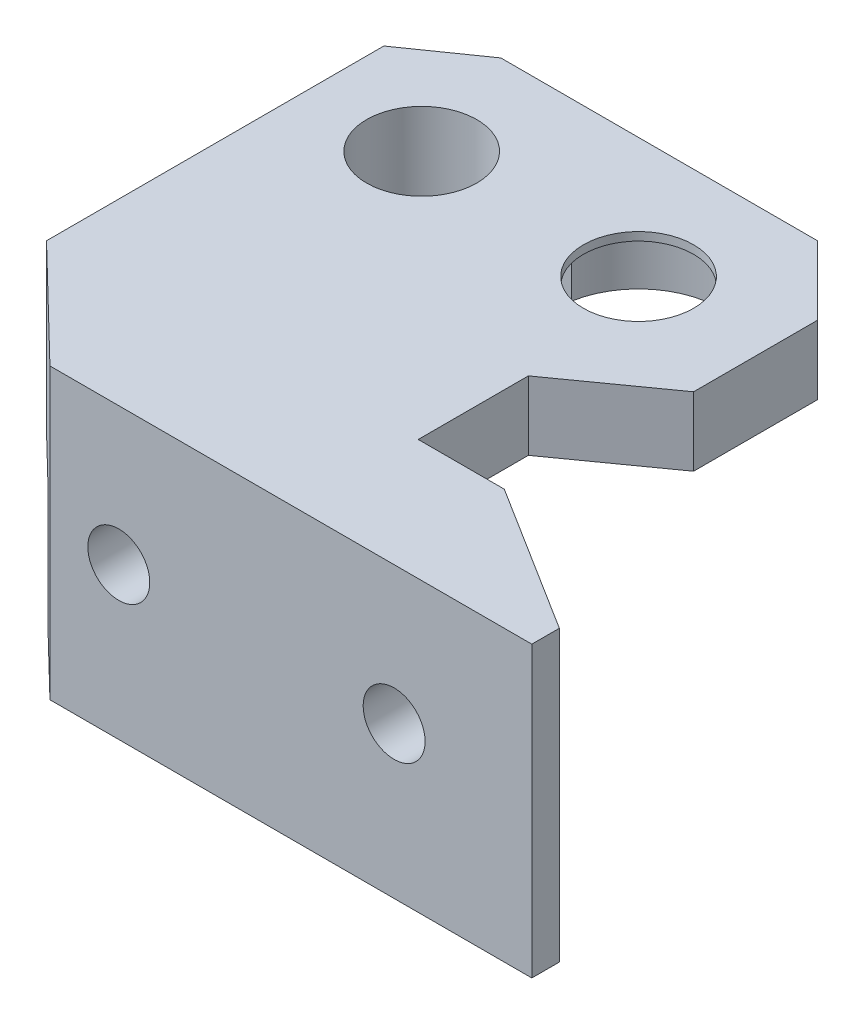
ISO-10303-21;
HEADER;
FILE_DESCRIPTION(('STEP AP214'),'2;1');
FILE_NAME('part.step','',(''),(''),'','','');
FILE_SCHEMA(('AUTOMOTIVE_DESIGN { 1 0 10303 214 1 1 1 1 }'));
ENDSEC;
DATA;
#1=APPLICATION_CONTEXT('core data for automotive mechanical design processes');
#2=APPLICATION_PROTOCOL_DEFINITION('international standard','automotive_design',2000,#1);
#3=PRODUCT_CONTEXT('',#1,'mechanical');
#4=PRODUCT('Part','Part','',(#3));
#5=PRODUCT_RELATED_PRODUCT_CATEGORY('part','',(#4));
#6=PRODUCT_DEFINITION_FORMATION('','',#4);
#7=PRODUCT_DEFINITION_CONTEXT('part definition',#1,'design');
#8=PRODUCT_DEFINITION('design','',#6,#7);
#9=PRODUCT_DEFINITION_SHAPE('','',#8);
#10=(LENGTH_UNIT() NAMED_UNIT(*) SI_UNIT(.MILLI.,.METRE.));
#11=(NAMED_UNIT(*) PLANE_ANGLE_UNIT() SI_UNIT($,.RADIAN.));
#12=(NAMED_UNIT(*) SI_UNIT($,.STERADIAN.) SOLID_ANGLE_UNIT());
#13=UNCERTAINTY_MEASURE_WITH_UNIT(LENGTH_MEASURE(1.E-05),#10,'distance_accuracy_value','');
#14=(GEOMETRIC_REPRESENTATION_CONTEXT(3) GLOBAL_UNCERTAINTY_ASSIGNED_CONTEXT((#13)) GLOBAL_UNIT_ASSIGNED_CONTEXT((#10,
#11,#12)) REPRESENTATION_CONTEXT('',''));
#15=CARTESIAN_POINT('',(0.,0.,0.));
#16=DIRECTION('',(0.,0.,1.));
#17=DIRECTION('',(1.,0.,0.));
#18=AXIS2_PLACEMENT_3D('',#15,#16,#17);
#19=CARTESIAN_POINT('',(-38.5,-7.,0.));
#20=DIRECTION('',(0.,1.,0.));
#21=DIRECTION('',(0.,0.,1.));
#22=AXIS2_PLACEMENT_3D('',#19,#20,#21);
#23=PLANE('',#22);
#24=DIRECTION('',(0.,0.,-1.));
#25=VECTOR('',#24,1.);
#26=CARTESIAN_POINT('',(-52.7141016151378,-7.,22.25));
#27=LINE('',#26,#25);
#28=CARTESIAN_POINT('',(-52.7141016151378,-7.,22.25));
#29=VERTEX_POINT('',#28);
#30=CARTESIAN_POINT('',(-52.7141016151378,-7.,18.25));
#31=VERTEX_POINT('',#30);
#32=EDGE_CURVE('E464',#29,#31,#27,.T.);
#33=ORIENTED_EDGE('',*,*,#32,.F.);
#34=DIRECTION('',(1.,0.,0.));
#35=VECTOR('',#34,1.);
#36=CARTESIAN_POINT('',(-23.6296296296296,-7.,22.25));
#37=LINE('',#36,#35);
#38=CARTESIAN_POINT('',(-59.1532258064516,-7.,22.25));
#39=VERTEX_POINT('',#38);
#40=EDGE_CURVE('E330',#39,#29,#37,.T.);
#41=ORIENTED_EDGE('',*,*,#40,.F.);
#42=DIRECTION('',(0.718240222789174,0.,0.695795215827012));
#43=VECTOR('',#42,1.);
#44=CARTESIAN_POINT('',(-59.1532258064516,-7.,22.25));
#45=LINE('',#44,#43);
#46=CARTESIAN_POINT('',(-62.25,-7.,19.25));
#47=VERTEX_POINT('',#46);
#48=EDGE_CURVE('E344',#47,#39,#45,.T.);
#49=ORIENTED_EDGE('',*,*,#48,.F.);
#50=DIRECTION('',(0.,0.,1.));
#51=VECTOR('',#50,1.);
#52=CARTESIAN_POINT('',(-62.25,-7.,19.25));
#53=LINE('',#52,#51);
#54=CARTESIAN_POINT('',(-62.25,-7.,-5.25));
#55=VERTEX_POINT('',#54);
#56=EDGE_CURVE('E535',#55,#47,#53,.T.);
#57=ORIENTED_EDGE('',*,*,#56,.F.);
#58=DIRECTION('',(-1.,0.,0.));
#59=VECTOR('',#58,1.);
#60=CARTESIAN_POINT('',(-62.25,-7.,-5.25));
#61=LINE('',#60,#59);
#62=CARTESIAN_POINT('',(-58.75,-7.,-5.25));
#63=VERTEX_POINT('',#62);
#64=EDGE_CURVE('E538',#63,#55,#61,.T.);
#65=ORIENTED_EDGE('',*,*,#64,.F.);
#66=DIRECTION('',(0.,0.,-1.));
#67=VECTOR('',#66,1.);
#68=CARTESIAN_POINT('',(-58.75,-7.,-5.25));
#69=LINE('',#68,#67);
#70=CARTESIAN_POINT('',(-58.75,-7.,18.25));
#71=VERTEX_POINT('',#70);
#72=EDGE_CURVE('E540',#71,#63,#69,.T.);
#73=ORIENTED_EDGE('',*,*,#72,.F.);
#74=DIRECTION('',(-1.,0.,0.));
#75=VECTOR('',#74,1.);
#76=CARTESIAN_POINT('',(-58.75,-7.,18.25));
#77=LINE('',#76,#75);
#78=EDGE_CURVE('E332',#31,#71,#77,.T.);
#79=ORIENTED_EDGE('',*,*,#78,.F.);
#80=EDGE_LOOP('',(#33,#41,#49,#57,#65,#73,#79));
#81=FACE_BOUND('',#80,.T.);
#82=ADVANCED_FACE('F32',(#81),#23,.F.);
#83=DIRECTION('',(0.,0.,-1.));
#84=VECTOR('',#83,1.);
#85=CARTESIAN_POINT('',(-45.7858983848622,-7.,22.25));
#86=LINE('',#85,#84);
#87=CARTESIAN_POINT('',(-45.7858983848622,-7.,18.25));
#88=VERTEX_POINT('',#87);
#89=CARTESIAN_POINT('',(-45.7858983848622,-7.,22.25));
#90=VERTEX_POINT('',#89);
#91=EDGE_CURVE('E461',#88,#90,#86,.F.);
#92=ORIENTED_EDGE('',*,*,#91,.F.);
#93=CARTESIAN_POINT('',(-32.7141016151378,-7.,18.25));
#94=VERTEX_POINT('',#93);
#95=EDGE_CURVE('E326',#94,#88,#77,.T.);
#96=ORIENTED_EDGE('',*,*,#95,.F.);
#97=DIRECTION('',(0.,0.,-1.));
#98=VECTOR('',#97,1.);
#99=CARTESIAN_POINT('',(-32.7141016151378,-7.,22.25));
#100=LINE('',#99,#98);
#101=CARTESIAN_POINT('',(-32.7141016151378,-7.,22.25));
#102=VERTEX_POINT('',#101);
#103=EDGE_CURVE('E319',#102,#94,#100,.T.);
#104=ORIENTED_EDGE('',*,*,#103,.F.);
#105=EDGE_CURVE('E328',#90,#102,#37,.T.);
#106=ORIENTED_EDGE('',*,*,#105,.F.);
#107=EDGE_LOOP('',(#92,#96,#104,#106));
#108=FACE_BOUND('',#107,.T.);
#109=ADVANCED_FACE('F291',(#108),#23,.F.);
#110=DIRECTION('',(0.,0.,-1.));
#111=VECTOR('',#110,1.);
#112=CARTESIAN_POINT('',(-25.7858983848622,-7.,22.25));
#113=LINE('',#112,#111);
#114=CARTESIAN_POINT('',(-25.7858983848622,-7.,20.8960638048539));
#115=VERTEX_POINT('',#114);
#116=CARTESIAN_POINT('',(-25.7858983848622,-7.,22.25));
#117=VERTEX_POINT('',#116);
#118=EDGE_CURVE('E312',#115,#117,#113,.F.);
#119=ORIENTED_EDGE('',*,*,#118,.F.);
#120=DIRECTION('',(-0.846889988853068,0.,-0.531768132535647));
#121=VECTOR('',#120,1.);
#122=CARTESIAN_POINT('',(-30.,-7.,18.25));
#123=LINE('',#122,#121);
#124=CARTESIAN_POINT('',(-23.6296296296296,-7.,22.25));
#125=VERTEX_POINT('',#124);
#126=EDGE_CURVE('E314',#125,#115,#123,.T.);
#127=ORIENTED_EDGE('',*,*,#126,.F.);
#128=EDGE_CURVE('E316',#117,#125,#37,.T.);
#129=ORIENTED_EDGE('',*,*,#128,.F.);
#130=EDGE_LOOP('',(#119,#127,#129));
#131=FACE_BOUND('',#130,.T.);
#132=ADVANCED_FACE('F294',(#131),#23,.F.);
#133=CARTESIAN_POINT('',(-19.25,5.,25.));
#134=DIRECTION('',(0.531768132535647,0.,-0.846889988853068));
#135=DIRECTION('',(-0.846889988853068,0.,-0.531768132535647));
#136=AXIS2_PLACEMENT_3D('',#133,#134,#135);
#137=PLANE('',#136);
#138=ORIENTED_EDGE('',*,*,#126,.T.);
#139=CARTESIAN_POINT('',(-29.25,-5.,18.7209302325581));
#140=DIRECTION('',(0.531768132535647,0.,-0.846889988853068));
#141=DIRECTION('',(-0.846889988853068,0.,-0.531768132535647));
#142=AXIS2_PLACEMENT_3D('',#139,#140,#141);
#143=ELLIPSE('',#142,4.72316363712971,4.);
#144=CARTESIAN_POINT('',(-30.,-1.07094158862457,18.25));
#145=VERTEX_POINT('',#144);
#146=EDGE_CURVE('E320',#115,#145,#143,.F.);
#147=ORIENTED_EDGE('',*,*,#146,.T.);
#148=DIRECTION('',(0.,-1.,0.));
#149=VECTOR('',#148,1.);
#150=CARTESIAN_POINT('',(-30.,5.,18.25));
#151=LINE('',#150,#149);
#152=CARTESIAN_POINT('',(-30.,5.,18.25));
#153=VERTEX_POINT('',#152);
#154=EDGE_CURVE('E411',#153,#145,#151,.T.);
#155=ORIENTED_EDGE('',*,*,#154,.F.);
#156=DIRECTION('',(0.846889988853068,0.,0.531768132535647));
#157=VECTOR('',#156,1.);
#158=CARTESIAN_POINT('',(-19.25,5.,25.));
#159=LINE('',#158,#157);
#160=CARTESIAN_POINT('',(-19.25,5.,25.));
#161=VERTEX_POINT('',#160);
#162=EDGE_CURVE('E372',#153,#161,#159,.T.);
#163=ORIENTED_EDGE('',*,*,#162,.T.);
#164=DIRECTION('',(0.,-1.,0.));
#165=VECTOR('',#164,1.);
#166=CARTESIAN_POINT('',(-19.25,5.,25.));
#167=LINE('',#166,#165);
#168=CARTESIAN_POINT('',(-19.25,-16.,25.));
#169=VERTEX_POINT('',#168);
#170=EDGE_CURVE('E222',#161,#169,#167,.T.);
#171=ORIENTED_EDGE('',*,*,#170,.T.);
#172=DIRECTION('',(-0.846889988853068,0.,-0.531768132535647));
#173=VECTOR('',#172,1.);
#174=CARTESIAN_POINT('',(-19.25,-16.,25.));
#175=LINE('',#174,#173);
#176=CARTESIAN_POINT('',(-23.6296296296296,-16.,22.25));
#177=VERTEX_POINT('',#176);
#178=EDGE_CURVE('E523',#169,#177,#175,.T.);
#179=ORIENTED_EDGE('',*,*,#178,.T.);
#180=DIRECTION('',(0.,1.,0.));
#181=VECTOR('',#180,1.);
#182=CARTESIAN_POINT('',(-23.6296296296296,-16.,22.25));
#183=LINE('',#182,#181);
#184=EDGE_CURVE('E325',#177,#125,#183,.T.);
#185=ORIENTED_EDGE('',*,*,#184,.T.);
#186=EDGE_LOOP('',(#138,#147,#155,#163,#171,#179,#185));
#187=FACE_BOUND('',#186,.T.);
#188=ADVANCED_FACE('F285',(#187),#137,.T.);
#189=CARTESIAN_POINT('',(-29.25,-5.,-8.75));
#190=DIRECTION('',(0.,0.,1.));
#191=DIRECTION('',(1.,0.,0.));
#192=AXIS2_PLACEMENT_3D('',#189,#190,#191);
#193=CYLINDRICAL_SURFACE('',#192,2.25);
#194=CARTESIAN_POINT('',(-29.25,-5.,27.));
#195=DIRECTION('',(0.,0.,-1.));
#196=DIRECTION('',(-1.,0.,0.));
#197=AXIS2_PLACEMENT_3D('',#194,#195,#196);
#198=CIRCLE('',#197,2.25);
#199=CARTESIAN_POINT('',(-31.5,-5.,27.));
#200=VERTEX_POINT('',#199);
#201=EDGE_CURVE('E466',#200,#200,#198,.T.);
#202=ORIENTED_EDGE('',*,*,#201,.F.);
#203=EDGE_LOOP('',(#202));
#204=FACE_BOUND('',#203,.T.);
#205=CARTESIAN_POINT('',(-29.25,-5.,22.25));
#206=DIRECTION('',(0.,0.,-1.));
#207=DIRECTION('',(-1.,0.,0.));
#208=AXIS2_PLACEMENT_3D('',#205,#206,#207);
#209=CIRCLE('',#208,2.25);
#210=CARTESIAN_POINT('',(-31.5,-5.,22.25));
#211=VERTEX_POINT('',#210);
#212=EDGE_CURVE('E263',#211,#211,#209,.F.);
#213=ORIENTED_EDGE('',*,*,#212,.F.);
#214=EDGE_LOOP('',(#213));
#215=FACE_BOUND('',#214,.T.);
#216=ADVANCED_FACE('F274',(#204,#215),#193,.F.);
#217=CARTESIAN_POINT('',(-49.25,-5.,-8.75));
#218=DIRECTION('',(0.,0.,1.));
#219=DIRECTION('',(1.,0.,0.));
#220=AXIS2_PLACEMENT_3D('',#217,#218,#219);
#221=CYLINDRICAL_SURFACE('',#220,2.25);
#222=CARTESIAN_POINT('',(-49.25,-5.,27.));
#223=DIRECTION('',(0.,0.,-1.));
#224=DIRECTION('',(-1.,0.,0.));
#225=AXIS2_PLACEMENT_3D('',#222,#223,#224);
#226=CIRCLE('',#225,2.25);
#227=CARTESIAN_POINT('',(-51.5,-5.,27.));
#228=VERTEX_POINT('',#227);
#229=EDGE_CURVE('E470',#228,#228,#226,.T.);
#230=ORIENTED_EDGE('',*,*,#229,.F.);
#231=EDGE_LOOP('',(#230));
#232=FACE_BOUND('',#231,.T.);
#233=CARTESIAN_POINT('',(-49.25,-5.,22.25));
#234=DIRECTION('',(0.,0.,-1.));
#235=DIRECTION('',(-1.,0.,0.));
#236=AXIS2_PLACEMENT_3D('',#233,#234,#235);
#237=CIRCLE('',#236,2.25);
#238=CARTESIAN_POINT('',(-51.5,-5.,22.25));
#239=VERTEX_POINT('',#238);
#240=EDGE_CURVE('E40',#239,#239,#237,.F.);
#241=ORIENTED_EDGE('',*,*,#240,.F.);
#242=EDGE_LOOP('',(#241));
#243=FACE_BOUND('',#242,.T.);
#244=ADVANCED_FACE('F271',(#232,#243),#221,.F.);
#245=CARTESIAN_POINT('',(-54.25,-2.5,0.));
#246=DIRECTION('',(0.,1.,0.));
#247=DIRECTION('',(0.,0.,1.));
#248=AXIS2_PLACEMENT_3D('',#245,#246,#247);
#249=CYLINDRICAL_SURFACE('',#248,7.);
#250=DIRECTION('',(0.,1.,0.));
#251=VECTOR('',#250,1.);
#252=CARTESIAN_POINT('',(-47.3217967697245,-2.5,1.));
#253=LINE('',#252,#251);
#254=CARTESIAN_POINT('',(-47.3217967697245,0.,1.));
#255=VERTEX_POINT('',#254);
#256=CARTESIAN_POINT('',(-47.3217967697245,-2.5,1.));
#257=VERTEX_POINT('',#256);
#258=EDGE_CURVE('E479',#255,#257,#253,.F.);
#259=ORIENTED_EDGE('',*,*,#258,.F.);
#260=CARTESIAN_POINT('',(-54.25,0.,0.));
#261=DIRECTION('',(0.,1.,0.));
#262=DIRECTION('',(0.,0.,-1.));
#263=AXIS2_PLACEMENT_3D('',#260,#261,#262);
#264=CIRCLE('',#263,7.);
#265=CARTESIAN_POINT('',(-58.75,0.,5.36190264738181));
#266=VERTEX_POINT('',#265);
#267=EDGE_CURVE('E516',#266,#255,#264,.T.);
#268=ORIENTED_EDGE('',*,*,#267,.F.);
#269=DIRECTION('',(0.,1.,0.));
#270=VECTOR('',#269,1.);
#271=CARTESIAN_POINT('',(-58.75,-2.5,5.36190264738181));
#272=LINE('',#271,#270);
#273=CARTESIAN_POINT('',(-58.75,-2.5,5.36190264738181));
#274=VERTEX_POINT('',#273);
#275=EDGE_CURVE('E254',#266,#274,#272,.F.);
#276=ORIENTED_EDGE('',*,*,#275,.T.);
#277=CARTESIAN_POINT('',(-54.25,-2.5,0.));
#278=DIRECTION('',(0.,1.,0.));
#279=DIRECTION('',(0.,0.,-1.));
#280=AXIS2_PLACEMENT_3D('',#277,#278,#279);
#281=CIRCLE('',#280,7.);
#282=EDGE_CURVE('E512',#274,#257,#281,.T.);
#283=ORIENTED_EDGE('',*,*,#282,.T.);
#284=EDGE_LOOP('',(#259,#268,#276,#283));
#285=FACE_BOUND('',#284,.T.);
#286=ADVANCED_FACE('F273',(#285),#249,.T.);
#287=CARTESIAN_POINT('',(-38.5,0.,0.));
#288=DIRECTION('',(0.,1.,0.));
#289=DIRECTION('',(0.,0.,1.));
#290=AXIS2_PLACEMENT_3D('',#287,#288,#289);
#291=PLANE('',#290);
#292=DIRECTION('',(-1.,0.,0.));
#293=VECTOR('',#292,1.);
#294=CARTESIAN_POINT('',(-44.3837822935834,0.,-1.));
#295=LINE('',#294,#293);
#296=CARTESIAN_POINT('',(-44.3837822935834,0.,-1.));
#297=VERTEX_POINT('',#296);
#298=CARTESIAN_POINT('',(-47.3217967697245,0.,-1.));
#299=VERTEX_POINT('',#298);
#300=EDGE_CURVE('E489',#297,#299,#295,.T.);
#301=ORIENTED_EDGE('',*,*,#300,.T.);
#302=CARTESIAN_POINT('',(-58.880064794363,0.,-5.25));
#303=VERTEX_POINT('',#302);
#304=EDGE_CURVE('E511',#299,#303,#264,.T.);
#305=ORIENTED_EDGE('',*,*,#304,.T.);
#306=DIRECTION('',(-1.,0.,0.));
#307=VECTOR('',#306,1.);
#308=CARTESIAN_POINT('',(-62.25,0.,-5.25));
#309=LINE('',#308,#307);
#310=CARTESIAN_POINT('',(-62.25,0.,-5.25));
#311=VERTEX_POINT('',#310);
#312=EDGE_CURVE('E338',#303,#311,#309,.T.);
#313=ORIENTED_EDGE('',*,*,#312,.T.);
#314=DIRECTION('',(0.819231920519041,0.,-0.573462344363328));
#315=VECTOR('',#314,1.);
#316=CARTESIAN_POINT('',(-57.25,0.,-8.75));
#317=LINE('',#316,#315);
#318=CARTESIAN_POINT('',(-57.25,0.,-8.75));
#319=VERTEX_POINT('',#318);
#320=EDGE_CURVE('E392',#311,#319,#317,.T.);
#321=ORIENTED_EDGE('',*,*,#320,.T.);
#322=DIRECTION('',(1.,0.,0.));
#323=VECTOR('',#322,1.);
#324=CARTESIAN_POINT('',(-34.25,0.,-8.75));
#325=LINE('',#324,#323);
#326=CARTESIAN_POINT('',(-34.25,0.,-8.75));
#327=VERTEX_POINT('',#326);
#328=EDGE_CURVE('E389',#319,#327,#325,.T.);
#329=ORIENTED_EDGE('',*,*,#328,.T.);
#330=DIRECTION('',(0.707106781186547,0.,0.707106781186548));
#331=VECTOR('',#330,1.);
#332=CARTESIAN_POINT('',(-29.25,0.,-3.75));
#333=LINE('',#332,#331);
#334=CARTESIAN_POINT('',(-29.25,0.,-3.75));
#335=VERTEX_POINT('',#334);
#336=EDGE_CURVE('E357',#327,#335,#333,.T.);
#337=ORIENTED_EDGE('',*,*,#336,.T.);
#338=DIRECTION('',(0.,0.,1.));
#339=VECTOR('',#338,1.);
#340=CARTESIAN_POINT('',(-29.25,0.,5.25));
#341=LINE('',#340,#339);
#342=CARTESIAN_POINT('',(-29.25,0.,5.25));
#343=VERTEX_POINT('',#342);
#344=EDGE_CURVE('E362',#335,#343,#341,.T.);
#345=ORIENTED_EDGE('',*,*,#344,.T.);
#346=DIRECTION('',(-0.813733471206735,0.,0.581238193719096));
#347=VECTOR('',#346,1.);
#348=CARTESIAN_POINT('',(-36.25,0.,10.25));
#349=LINE('',#348,#347);
#350=CARTESIAN_POINT('',(-36.25,0.,10.25));
#351=VERTEX_POINT('',#350);
#352=EDGE_CURVE('E398',#343,#351,#349,.T.);
#353=ORIENTED_EDGE('',*,*,#352,.T.);
#354=DIRECTION('',(0.,0.,1.));
#355=VECTOR('',#354,1.);
#356=CARTESIAN_POINT('',(-36.25,0.,18.25));
#357=LINE('',#356,#355);
#358=CARTESIAN_POINT('',(-36.25,0.,18.25));
#359=VERTEX_POINT('',#358);
#360=EDGE_CURVE('E395',#351,#359,#357,.T.);
#361=ORIENTED_EDGE('',*,*,#360,.T.);
#362=DIRECTION('',(-1.,0.,0.));
#363=VECTOR('',#362,1.);
#364=CARTESIAN_POINT('',(-38.5,0.,18.25));
#365=LINE('',#364,#363);
#366=CARTESIAN_POINT('',(-58.75,0.,18.25));
#367=VERTEX_POINT('',#366);
#368=EDGE_CURVE('E243',#359,#367,#365,.T.);
#369=ORIENTED_EDGE('',*,*,#368,.T.);
#370=DIRECTION('',(0.,0.,-1.));
#371=VECTOR('',#370,1.);
#372=CARTESIAN_POINT('',(-58.75,0.,-5.25));
#373=LINE('',#372,#371);
#374=EDGE_CURVE('E340',#367,#266,#373,.T.);
#375=ORIENTED_EDGE('',*,*,#374,.T.);
#376=ORIENTED_EDGE('',*,*,#267,.T.);
#377=DIRECTION('',(1.,0.,0.));
#378=VECTOR('',#377,1.);
#379=CARTESIAN_POINT('',(-44.3837822935834,0.,1.));
#380=LINE('',#379,#378);
#381=CARTESIAN_POINT('',(-44.3837822935834,0.,1.));
#382=VERTEX_POINT('',#381);
#383=EDGE_CURVE('E497',#255,#382,#380,.T.);
#384=ORIENTED_EDGE('',*,*,#383,.T.);
#385=CARTESIAN_POINT('',(-38.5,0.,0.));
#386=DIRECTION('',(0.,1.,0.));
#387=DIRECTION('',(0.,0.,-1.));
#388=AXIS2_PLACEMENT_3D('',#385,#386,#387);
#389=CIRCLE('',#388,5.96815667340306);
#390=EDGE_CURVE('E484',#382,#297,#389,.T.);
#391=ORIENTED_EDGE('',*,*,#390,.T.);
#392=EDGE_LOOP('',(#301,#305,#313,#321,#329,#337,#345,#353,#361,#369,#375,#376,#384,#391));
#393=FACE_BOUND('',#392,.T.);
#394=ADVANCED_FACE('F281',(#393),#291,.F.);
#395=CARTESIAN_POINT('',(-38.5,5.,0.));
#396=DIRECTION('',(0.,-1.,0.));
#397=DIRECTION('',(0.,0.,-1.));
#398=AXIS2_PLACEMENT_3D('',#395,#396,#397);
#399=CYLINDRICAL_SURFACE('',#398,4.);
#400=CARTESIAN_POINT('',(-38.5,5.,0.));
#401=DIRECTION('',(0.,-1.,0.));
#402=DIRECTION('',(0.,0.,1.));
#403=AXIS2_PLACEMENT_3D('',#400,#401,#402);
#404=CIRCLE('',#403,4.);
#405=CARTESIAN_POINT('',(-38.5,5.,4.));
#406=VERTEX_POINT('',#405);
#407=EDGE_CURVE('E354',#406,#406,#404,.T.);
#408=ORIENTED_EDGE('',*,*,#407,.F.);
#409=EDGE_LOOP('',(#408));
#410=FACE_BOUND('',#409,.T.);
#411=CARTESIAN_POINT('',(-38.5,4.4,0.));
#412=DIRECTION('',(0.,-1.,0.));
#413=DIRECTION('',(0.,0.,-1.));
#414=AXIS2_PLACEMENT_3D('',#411,#412,#413);
#415=CIRCLE('',#414,4.);
#416=CARTESIAN_POINT('',(-38.5,4.4,-4.));
#417=VERTEX_POINT('',#416);
#418=EDGE_CURVE('E504',#417,#417,#415,.F.);
#419=ORIENTED_EDGE('',*,*,#418,.F.);
#420=EDGE_LOOP('',(#419));
#421=FACE_BOUND('',#420,.T.);
#422=ADVANCED_FACE('F587',(#410,#421),#399,.F.);
#423=CARTESIAN_POINT('',(-54.25,5.,0.));
#424=DIRECTION('',(0.,-1.,0.));
#425=DIRECTION('',(0.,0.,-1.));
#426=AXIS2_PLACEMENT_3D('',#423,#424,#425);
#427=CYLINDRICAL_SURFACE('',#426,4.);
#428=DIRECTION('',(0.,-1.,0.));
#429=VECTOR('',#428,1.);
#430=CARTESIAN_POINT('',(-50.3770166537926,5.,1.));
#431=LINE('',#430,#429);
#432=CARTESIAN_POINT('',(-50.3770166537926,-2.5,0.999999999999999));
#433=VERTEX_POINT('',#432);
#434=CARTESIAN_POINT('',(-50.3770166537926,4.4,1.));
#435=VERTEX_POINT('',#434);
#436=EDGE_CURVE('E257',#433,#435,#431,.F.);
#437=ORIENTED_EDGE('',*,*,#436,.F.);
#438=CARTESIAN_POINT('',(-54.25,-2.5,0.));
#439=DIRECTION('',(0.,1.,0.));
#440=DIRECTION('',(0.,0.,-1.));
#441=AXIS2_PLACEMENT_3D('',#438,#439,#440);
#442=CIRCLE('',#441,4.);
#443=CARTESIAN_POINT('',(-50.3770166537926,-2.5,-1.));
#444=VERTEX_POINT('',#443);
#445=EDGE_CURVE('E508',#444,#433,#442,.T.);
#446=ORIENTED_EDGE('',*,*,#445,.F.);
#447=DIRECTION('',(0.,-1.,0.));
#448=VECTOR('',#447,1.);
#449=CARTESIAN_POINT('',(-50.3770166537926,5.,-1.));
#450=LINE('',#449,#448);
#451=CARTESIAN_POINT('',(-50.3770166537926,4.4,-1.));
#452=VERTEX_POINT('',#451);
#453=EDGE_CURVE('E259',#452,#444,#450,.T.);
#454=ORIENTED_EDGE('',*,*,#453,.F.);
#455=CARTESIAN_POINT('',(-54.25,4.4,0.));
#456=DIRECTION('',(0.,-1.,0.));
#457=DIRECTION('',(0.,0.,-1.));
#458=AXIS2_PLACEMENT_3D('',#455,#456,#457);
#459=CIRCLE('',#458,4.);
#460=EDGE_CURVE('E261',#435,#452,#459,.F.);
#461=ORIENTED_EDGE('',*,*,#460,.F.);
#462=EDGE_LOOP('',(#437,#446,#454,#461));
#463=FACE_BOUND('',#462,.T.);
#464=CARTESIAN_POINT('',(-54.25,5.,0.));
#465=DIRECTION('',(0.,-1.,0.));
#466=DIRECTION('',(0.,0.,1.));
#467=AXIS2_PLACEMENT_3D('',#464,#465,#466);
#468=CIRCLE('',#467,4.);
#469=CARTESIAN_POINT('',(-54.25,5.,4.));
#470=VERTEX_POINT('',#469);
#471=EDGE_CURVE('E351',#470,#470,#468,.T.);
#472=ORIENTED_EDGE('',*,*,#471,.F.);
#473=EDGE_LOOP('',(#472));
#474=FACE_BOUND('',#473,.T.);
#475=ADVANCED_FACE('F577',(#463,#474),#427,.F.);
#476=CARTESIAN_POINT('',(0.,5.,0.));
#477=DIRECTION('',(0.,1.,0.));
#478=DIRECTION('',(0.,0.,1.));
#479=AXIS2_PLACEMENT_3D('',#476,#477,#478);
#480=PLANE('',#479);
#481=DIRECTION('',(0.,0.,1.));
#482=VECTOR('',#481,1.);
#483=CARTESIAN_POINT('',(-19.25,5.,27.));
#484=LINE('',#483,#482);
#485=CARTESIAN_POINT('',(-19.25,5.,27.));
#486=VERTEX_POINT('',#485);
#487=EDGE_CURVE('E219',#161,#486,#484,.T.);
#488=ORIENTED_EDGE('',*,*,#487,.F.);
#489=ORIENTED_EDGE('',*,*,#162,.F.);
#490=DIRECTION('',(1.,0.,0.));
#491=VECTOR('',#490,1.);
#492=CARTESIAN_POINT('',(-30.,5.,18.25));
#493=LINE('',#492,#491);
#494=CARTESIAN_POINT('',(-36.25,5.,18.25));
#495=VERTEX_POINT('',#494);
#496=EDGE_CURVE('E374',#495,#153,#493,.T.);
#497=ORIENTED_EDGE('',*,*,#496,.F.);
#498=DIRECTION('',(0.,0.,1.));
#499=VECTOR('',#498,1.);
#500=CARTESIAN_POINT('',(-36.25,5.,18.25));
#501=LINE('',#500,#499);
#502=CARTESIAN_POINT('',(-36.25,5.,10.25));
#503=VERTEX_POINT('',#502);
#504=EDGE_CURVE('E377',#503,#495,#501,.T.);
#505=ORIENTED_EDGE('',*,*,#504,.F.);
#506=DIRECTION('',(-0.813733471206735,0.,0.581238193719096));
#507=VECTOR('',#506,1.);
#508=CARTESIAN_POINT('',(-36.25,5.,10.25));
#509=LINE('',#508,#507);
#510=CARTESIAN_POINT('',(-29.25,5.,5.25));
#511=VERTEX_POINT('',#510);
#512=EDGE_CURVE('E380',#511,#503,#509,.T.);
#513=ORIENTED_EDGE('',*,*,#512,.F.);
#514=DIRECTION('',(0.,0.,1.));
#515=VECTOR('',#514,1.);
#516=CARTESIAN_POINT('',(-29.25,5.,5.25));
#517=LINE('',#516,#515);
#518=CARTESIAN_POINT('',(-29.25,5.,-3.75));
#519=VERTEX_POINT('',#518);
#520=EDGE_CURVE('E383',#519,#511,#517,.T.);
#521=ORIENTED_EDGE('',*,*,#520,.F.);
#522=DIRECTION('',(0.707106781186547,0.,0.707106781186548));
#523=VECTOR('',#522,1.);
#524=CARTESIAN_POINT('',(-29.25,5.,-3.75));
#525=LINE('',#524,#523);
#526=CARTESIAN_POINT('',(-34.25,5.,-8.75));
#527=VERTEX_POINT('',#526);
#528=EDGE_CURVE('E358',#527,#519,#525,.T.);
#529=ORIENTED_EDGE('',*,*,#528,.F.);
#530=DIRECTION('',(1.,0.,0.));
#531=VECTOR('',#530,1.);
#532=CARTESIAN_POINT('',(-34.25,5.,-8.75));
#533=LINE('',#532,#531);
#534=CARTESIAN_POINT('',(-57.25,5.,-8.75));
#535=VERTEX_POINT('',#534);
#536=EDGE_CURVE('E361',#535,#527,#533,.T.);
#537=ORIENTED_EDGE('',*,*,#536,.F.);
#538=DIRECTION('',(0.819231920519041,0.,-0.573462344363328));
#539=VECTOR('',#538,1.);
#540=CARTESIAN_POINT('',(-57.25,5.,-8.75));
#541=LINE('',#540,#539);
#542=CARTESIAN_POINT('',(-62.25,5.,-5.25));
#543=VERTEX_POINT('',#542);
#544=EDGE_CURVE('E365',#543,#535,#541,.T.);
#545=ORIENTED_EDGE('',*,*,#544,.F.);
#546=DIRECTION('',(0.,0.,-1.));
#547=VECTOR('',#546,1.);
#548=CARTESIAN_POINT('',(-62.25,5.,-5.25));
#549=LINE('',#548,#547);
#550=CARTESIAN_POINT('',(-62.25,5.,19.25));
#551=VERTEX_POINT('',#550);
#552=EDGE_CURVE('E368',#551,#543,#549,.T.);
#553=ORIENTED_EDGE('',*,*,#552,.F.);
#554=DIRECTION('',(-0.718240222789174,0.,-0.695795215827012));
#555=VECTOR('',#554,1.);
#556=CARTESIAN_POINT('',(-62.25,5.,19.25));
#557=LINE('',#556,#555);
#558=CARTESIAN_POINT('',(-54.25,5.,27.));
#559=VERTEX_POINT('',#558);
#560=EDGE_CURVE('E241',#559,#551,#557,.T.);
#561=ORIENTED_EDGE('',*,*,#560,.F.);
#562=DIRECTION('',(1.,0.,0.));
#563=VECTOR('',#562,1.);
#564=CARTESIAN_POINT('',(15.75,5.,27.));
#565=LINE('',#564,#563);
#566=EDGE_CURVE('E231',#559,#486,#565,.T.);
#567=ORIENTED_EDGE('',*,*,#566,.T.);
#568=EDGE_LOOP('',(#488,#489,#497,#505,#513,#521,#529,#537,#545,#553,#561,#567));
#569=FACE_BOUND('',#568,.T.);
#570=ORIENTED_EDGE('',*,*,#471,.T.);
#571=EDGE_LOOP('',(#570));
#572=FACE_BOUND('',#571,.T.);
#573=ORIENTED_EDGE('',*,*,#407,.T.);
#574=EDGE_LOOP('',(#573));
#575=FACE_BOUND('',#574,.T.);
#576=ADVANCED_FACE('F237',(#569,#572,#575),#480,.T.);
#577=CARTESIAN_POINT('',(15.75,5.,27.));
#578=DIRECTION('',(0.,0.,-1.));
#579=DIRECTION('',(-1.,0.,0.));
#580=AXIS2_PLACEMENT_3D('',#577,#578,#579);
#581=PLANE('',#580);
#582=ORIENTED_EDGE('',*,*,#229,.T.);
#583=EDGE_LOOP('',(#582));
#584=FACE_BOUND('',#583,.T.);
#585=ORIENTED_EDGE('',*,*,#201,.T.);
#586=EDGE_LOOP('',(#585));
#587=FACE_BOUND('',#586,.T.);
#588=DIRECTION('',(-1.,0.,0.));
#589=VECTOR('',#588,1.);
#590=CARTESIAN_POINT('',(15.75,-16.,27.));
#591=LINE('',#590,#589);
#592=CARTESIAN_POINT('',(-19.25,-16.,27.));
#593=VERTEX_POINT('',#592);
#594=CARTESIAN_POINT('',(-54.25,-16.,27.));
#595=VERTEX_POINT('',#594);
#596=EDGE_CURVE('E233',#593,#595,#591,.T.);
#597=ORIENTED_EDGE('',*,*,#596,.F.);
#598=DIRECTION('',(0.,1.,0.));
#599=VECTOR('',#598,1.);
#600=CARTESIAN_POINT('',(-19.25,-16.,27.));
#601=LINE('',#600,#599);
#602=EDGE_CURVE('E47',#593,#486,#601,.T.);
#603=ORIENTED_EDGE('',*,*,#602,.T.);
#604=ORIENTED_EDGE('',*,*,#566,.F.);
#605=DIRECTION('',(0.,-1.,0.));
#606=VECTOR('',#605,1.);
#607=CARTESIAN_POINT('',(-54.25,5.,27.));
#608=LINE('',#607,#606);
#609=EDGE_CURVE('E413',#559,#595,#608,.T.);
#610=ORIENTED_EDGE('',*,*,#609,.T.);
#611=EDGE_LOOP('',(#597,#603,#604,#610));
#612=FACE_BOUND('',#611,.T.);
#613=ADVANCED_FACE('F34',(#584,#587,#612),#581,.F.);
#614=CARTESIAN_POINT('',(0.,-16.,0.));
#615=DIRECTION('',(0.,1.,0.));
#616=DIRECTION('',(0.,0.,1.));
#617=AXIS2_PLACEMENT_3D('',#614,#615,#616);
#618=PLANE('',#617);
#619=ORIENTED_EDGE('',*,*,#178,.F.);
#620=DIRECTION('',(0.,0.,1.));
#621=VECTOR('',#620,1.);
#622=CARTESIAN_POINT('',(-19.25,-16.,0.));
#623=LINE('',#622,#621);
#624=EDGE_CURVE('E11',#169,#593,#623,.T.);
#625=ORIENTED_EDGE('',*,*,#624,.T.);
#626=ORIENTED_EDGE('',*,*,#596,.T.);
#627=DIRECTION('',(0.718240222789174,0.,0.695795215827012));
#628=VECTOR('',#627,1.);
#629=CARTESIAN_POINT('',(-59.1532258064516,-16.,22.25));
#630=LINE('',#629,#628);
#631=CARTESIAN_POINT('',(-59.1532258064516,-16.,22.25));
#632=VERTEX_POINT('',#631);
#633=EDGE_CURVE('E525',#632,#595,#630,.T.);
#634=ORIENTED_EDGE('',*,*,#633,.F.);
#635=DIRECTION('',(-1.,0.,0.));
#636=VECTOR('',#635,1.);
#637=CARTESIAN_POINT('',(-23.6296296296296,-16.,22.25));
#638=LINE('',#637,#636);
#639=EDGE_CURVE('E528',#177,#632,#638,.T.);
#640=ORIENTED_EDGE('',*,*,#639,.F.);
#641=EDGE_LOOP('',(#619,#625,#626,#634,#640));
#642=FACE_BOUND('',#641,.T.);
#643=ADVANCED_FACE('F622',(#642),#618,.F.);
#644=CARTESIAN_POINT('',(-29.25,5.,-3.75));
#645=DIRECTION('',(0.707106781186548,0.,-0.707106781186547));
#646=DIRECTION('',(-0.707106781186547,0.,-0.707106781186548));
#647=AXIS2_PLACEMENT_3D('',#644,#645,#646);
#648=PLANE('',#647);
#649=ORIENTED_EDGE('',*,*,#336,.F.);
#650=DIRECTION('',(0.,-1.,0.));
#651=VECTOR('',#650,1.);
#652=CARTESIAN_POINT('',(-34.25,5.,-8.75));
#653=LINE('',#652,#651);
#654=EDGE_CURVE('E245',#527,#327,#653,.T.);
#655=ORIENTED_EDGE('',*,*,#654,.F.);
#656=ORIENTED_EDGE('',*,*,#528,.T.);
#657=DIRECTION('',(0.,-1.,0.));
#658=VECTOR('',#657,1.);
#659=CARTESIAN_POINT('',(-29.25,5.,-3.75));
#660=LINE('',#659,#658);
#661=EDGE_CURVE('E386',#519,#335,#660,.T.);
#662=ORIENTED_EDGE('',*,*,#661,.T.);
#663=EDGE_LOOP('',(#649,#655,#656,#662));
#664=FACE_BOUND('',#663,.T.);
#665=ADVANCED_FACE('F428',(#664),#648,.T.);
#666=CARTESIAN_POINT('',(-34.25,5.,-8.75));
#667=DIRECTION('',(0.,0.,-1.));
#668=DIRECTION('',(-1.,0.,0.));
#669=AXIS2_PLACEMENT_3D('',#666,#667,#668);
#670=PLANE('',#669);
#671=ORIENTED_EDGE('',*,*,#328,.F.);
#672=DIRECTION('',(0.,-1.,0.));
#673=VECTOR('',#672,1.);
#674=CARTESIAN_POINT('',(-57.25,5.,-8.75));
#675=LINE('',#674,#673);
#676=EDGE_CURVE('E420',#535,#319,#675,.T.);
#677=ORIENTED_EDGE('',*,*,#676,.F.);
#678=ORIENTED_EDGE('',*,*,#536,.T.);
#679=ORIENTED_EDGE('',*,*,#654,.T.);
#680=EDGE_LOOP('',(#671,#677,#678,#679));
#681=FACE_BOUND('',#680,.T.);
#682=ADVANCED_FACE('F424',(#681),#670,.T.);
#683=CARTESIAN_POINT('',(-57.25,5.,-8.75));
#684=DIRECTION('',(-0.573462344363328,0.,-0.819231920519041));
#685=DIRECTION('',(-0.819231920519041,0.,0.573462344363328));
#686=AXIS2_PLACEMENT_3D('',#683,#684,#685);
#687=PLANE('',#686);
#688=ORIENTED_EDGE('',*,*,#320,.F.);
#689=DIRECTION('',(0.,-1.,0.));
#690=VECTOR('',#689,1.);
#691=CARTESIAN_POINT('',(-62.25,5.,-5.25));
#692=LINE('',#691,#690);
#693=EDGE_CURVE('E417',#543,#311,#692,.T.);
#694=ORIENTED_EDGE('',*,*,#693,.F.);
#695=ORIENTED_EDGE('',*,*,#544,.T.);
#696=ORIENTED_EDGE('',*,*,#676,.T.);
#697=EDGE_LOOP('',(#688,#694,#695,#696));
#698=FACE_BOUND('',#697,.T.);
#699=ADVANCED_FACE('F435',(#698),#687,.T.);
#700=CARTESIAN_POINT('',(-62.25,5.,-5.25));
#701=DIRECTION('',(-1.,0.,0.));
#702=DIRECTION('',(0.,0.,1.));
#703=AXIS2_PLACEMENT_3D('',#700,#701,#702);
#704=PLANE('',#703);
#705=ORIENTED_EDGE('',*,*,#693,.T.);
#706=DIRECTION('',(0.,1.,0.));
#707=VECTOR('',#706,1.);
#708=CARTESIAN_POINT('',(-62.25,-7.,-5.25));
#709=LINE('',#708,#707);
#710=EDGE_CURVE('E348',#55,#311,#709,.T.);
#711=ORIENTED_EDGE('',*,*,#710,.F.);
#712=ORIENTED_EDGE('',*,*,#56,.T.);
#713=DIRECTION('',(0.,-1.,0.));
#714=VECTOR('',#713,1.);
#715=CARTESIAN_POINT('',(-62.25,5.,19.25));
#716=LINE('',#715,#714);
#717=EDGE_CURVE('E415',#551,#47,#716,.T.);
#718=ORIENTED_EDGE('',*,*,#717,.F.);
#719=ORIENTED_EDGE('',*,*,#552,.T.);
#720=EDGE_LOOP('',(#705,#711,#712,#718,#719));
#721=FACE_BOUND('',#720,.T.);
#722=ADVANCED_FACE('F611',(#721),#704,.T.);
#723=CARTESIAN_POINT('',(-62.25,5.,19.25));
#724=DIRECTION('',(-0.695795215827012,0.,0.718240222789174));
#725=DIRECTION('',(0.718240222789174,0.,0.695795215827012));
#726=AXIS2_PLACEMENT_3D('',#723,#724,#725);
#727=PLANE('',#726);
#728=ORIENTED_EDGE('',*,*,#633,.T.);
#729=ORIENTED_EDGE('',*,*,#609,.F.);
#730=ORIENTED_EDGE('',*,*,#560,.T.);
#731=ORIENTED_EDGE('',*,*,#717,.T.);
#732=ORIENTED_EDGE('',*,*,#48,.T.);
#733=DIRECTION('',(0.,1.,0.));
#734=VECTOR('',#733,1.);
#735=CARTESIAN_POINT('',(-59.1532258064516,-16.,22.25));
#736=LINE('',#735,#734);
#737=EDGE_CURVE('E341',#632,#39,#736,.T.);
#738=ORIENTED_EDGE('',*,*,#737,.F.);
#739=EDGE_LOOP('',(#728,#729,#730,#731,#732,#738));
#740=FACE_BOUND('',#739,.T.);
#741=ADVANCED_FACE('F607',(#740),#727,.T.);
#742=CARTESIAN_POINT('',(-30.,5.,18.25));
#743=DIRECTION('',(0.,0.,-1.));
#744=DIRECTION('',(-1.,0.,0.));
#745=AXIS2_PLACEMENT_3D('',#742,#743,#744);
#746=PLANE('',#745);
#747=ORIENTED_EDGE('',*,*,#95,.T.);
#748=CARTESIAN_POINT('',(-49.25,-5.,18.25));
#749=DIRECTION('',(0.,0.,1.));
#750=DIRECTION('',(1.,0.,0.));
#751=AXIS2_PLACEMENT_3D('',#748,#749,#750);
#752=CIRCLE('',#751,4.);
#753=EDGE_CURVE('E547',#88,#31,#752,.T.);
#754=ORIENTED_EDGE('',*,*,#753,.T.);
#755=ORIENTED_EDGE('',*,*,#78,.T.);
#756=DIRECTION('',(0.,1.,0.));
#757=VECTOR('',#756,1.);
#758=CARTESIAN_POINT('',(-58.75,-7.,18.25));
#759=LINE('',#758,#757);
#760=EDGE_CURVE('E337',#71,#367,#759,.T.);
#761=ORIENTED_EDGE('',*,*,#760,.T.);
#762=ORIENTED_EDGE('',*,*,#368,.F.);
#763=DIRECTION('',(0.,-1.,0.));
#764=VECTOR('',#763,1.);
#765=CARTESIAN_POINT('',(-36.25,5.,18.25));
#766=LINE('',#765,#764);
#767=EDGE_CURVE('E408',#495,#359,#766,.T.);
#768=ORIENTED_EDGE('',*,*,#767,.F.);
#769=ORIENTED_EDGE('',*,*,#496,.T.);
#770=ORIENTED_EDGE('',*,*,#154,.T.);
#771=CARTESIAN_POINT('',(-29.25,-5.,18.25));
#772=DIRECTION('',(0.,0.,1.));
#773=DIRECTION('',(1.,0.,0.));
#774=AXIS2_PLACEMENT_3D('',#771,#772,#773);
#775=CIRCLE('',#774,4.);
#776=EDGE_CURVE('E234',#145,#94,#775,.T.);
#777=ORIENTED_EDGE('',*,*,#776,.T.);
#778=EDGE_LOOP('',(#747,#754,#755,#761,#762,#768,#769,#770,#777));
#779=FACE_BOUND('',#778,.T.);
#780=ADVANCED_FACE('F450',(#779),#746,.T.);
#781=CARTESIAN_POINT('',(-36.25,5.,18.25));
#782=DIRECTION('',(1.,0.,0.));
#783=DIRECTION('',(0.,0.,-1.));
#784=AXIS2_PLACEMENT_3D('',#781,#782,#783);
#785=PLANE('',#784);
#786=ORIENTED_EDGE('',*,*,#360,.F.);
#787=DIRECTION('',(0.,-1.,0.));
#788=VECTOR('',#787,1.);
#789=CARTESIAN_POINT('',(-36.25,5.,10.25));
#790=LINE('',#789,#788);
#791=EDGE_CURVE('E406',#503,#351,#790,.T.);
#792=ORIENTED_EDGE('',*,*,#791,.F.);
#793=ORIENTED_EDGE('',*,*,#504,.T.);
#794=ORIENTED_EDGE('',*,*,#767,.T.);
#795=EDGE_LOOP('',(#786,#792,#793,#794));
#796=FACE_BOUND('',#795,.T.);
#797=ADVANCED_FACE('F447',(#796),#785,.T.);
#798=CARTESIAN_POINT('',(-36.25,5.,10.25));
#799=DIRECTION('',(0.581238193719096,0.,0.813733471206735));
#800=DIRECTION('',(0.813733471206735,0.,-0.581238193719096));
#801=AXIS2_PLACEMENT_3D('',#798,#799,#800);
#802=PLANE('',#801);
#803=ORIENTED_EDGE('',*,*,#352,.F.);
#804=DIRECTION('',(0.,-1.,0.));
#805=VECTOR('',#804,1.);
#806=CARTESIAN_POINT('',(-29.25,5.,5.25));
#807=LINE('',#806,#805);
#808=EDGE_CURVE('E404',#511,#343,#807,.T.);
#809=ORIENTED_EDGE('',*,*,#808,.F.);
#810=ORIENTED_EDGE('',*,*,#512,.T.);
#811=ORIENTED_EDGE('',*,*,#791,.T.);
#812=EDGE_LOOP('',(#803,#809,#810,#811));
#813=FACE_BOUND('',#812,.T.);
#814=ADVANCED_FACE('F445',(#813),#802,.T.);
#815=CARTESIAN_POINT('',(-29.25,5.,5.25));
#816=DIRECTION('',(1.,0.,0.));
#817=DIRECTION('',(0.,0.,-1.));
#818=AXIS2_PLACEMENT_3D('',#815,#816,#817);
#819=PLANE('',#818);
#820=ORIENTED_EDGE('',*,*,#344,.F.);
#821=ORIENTED_EDGE('',*,*,#661,.F.);
#822=ORIENTED_EDGE('',*,*,#520,.T.);
#823=ORIENTED_EDGE('',*,*,#808,.T.);
#824=EDGE_LOOP('',(#820,#821,#822,#823));
#825=FACE_BOUND('',#824,.T.);
#826=ADVANCED_FACE('F441',(#825),#819,.T.);
#827=CARTESIAN_POINT('',(-62.25,-7.,-5.25));
#828=DIRECTION('',(0.,0.,-1.));
#829=DIRECTION('',(-1.,0.,0.));
#830=AXIS2_PLACEMENT_3D('',#827,#828,#829);
#831=PLANE('',#830);
#832=DIRECTION('',(0.,1.,0.));
#833=VECTOR('',#832,1.);
#834=CARTESIAN_POINT('',(-58.880064794363,-2.5,-5.25));
#835=LINE('',#834,#833);
#836=CARTESIAN_POINT('',(-58.880064794363,-2.5,-5.25));
#837=VERTEX_POINT('',#836);
#838=EDGE_CURVE('E521',#837,#303,#835,.T.);
#839=ORIENTED_EDGE('',*,*,#838,.F.);
#840=DIRECTION('',(-1.,0.,0.));
#841=VECTOR('',#840,1.);
#842=CARTESIAN_POINT('',(-62.25,-2.5,-5.25));
#843=LINE('',#842,#841);
#844=CARTESIAN_POINT('',(-58.75,-2.5,-5.25));
#845=VERTEX_POINT('',#844);
#846=EDGE_CURVE('E515',#845,#837,#843,.T.);
#847=ORIENTED_EDGE('',*,*,#846,.F.);
#848=DIRECTION('',(0.,1.,0.));
#849=VECTOR('',#848,1.);
#850=CARTESIAN_POINT('',(-58.75,-7.,-5.25));
#851=LINE('',#850,#849);
#852=EDGE_CURVE('E346',#63,#845,#851,.T.);
#853=ORIENTED_EDGE('',*,*,#852,.F.);
#854=ORIENTED_EDGE('',*,*,#64,.T.);
#855=ORIENTED_EDGE('',*,*,#710,.T.);
#856=ORIENTED_EDGE('',*,*,#312,.F.);
#857=EDGE_LOOP('',(#839,#847,#853,#854,#855,#856));
#858=FACE_BOUND('',#857,.T.);
#859=ADVANCED_FACE('F553',(#858),#831,.T.);
#860=CARTESIAN_POINT('',(-58.75,-7.,-5.25));
#861=DIRECTION('',(1.,0.,0.));
#862=DIRECTION('',(0.,0.,-1.));
#863=AXIS2_PLACEMENT_3D('',#860,#861,#862);
#864=PLANE('',#863);
#865=ORIENTED_EDGE('',*,*,#275,.F.);
#866=ORIENTED_EDGE('',*,*,#374,.F.);
#867=ORIENTED_EDGE('',*,*,#760,.F.);
#868=ORIENTED_EDGE('',*,*,#72,.T.);
#869=ORIENTED_EDGE('',*,*,#852,.T.);
#870=DIRECTION('',(0.,0.,-1.));
#871=VECTOR('',#870,1.);
#872=CARTESIAN_POINT('',(-58.75,-2.5,-5.25));
#873=LINE('',#872,#871);
#874=EDGE_CURVE('E251',#274,#845,#873,.T.);
#875=ORIENTED_EDGE('',*,*,#874,.F.);
#876=EDGE_LOOP('',(#865,#866,#867,#868,#869,#875));
#877=FACE_BOUND('',#876,.T.);
#878=ADVANCED_FACE('F548',(#877),#864,.T.);
#879=CARTESIAN_POINT('',(-23.6296296296296,-16.,22.25));
#880=DIRECTION('',(0.,0.,-1.));
#881=DIRECTION('',(-1.,0.,0.));
#882=AXIS2_PLACEMENT_3D('',#879,#880,#881);
#883=PLANE('',#882);
#884=ORIENTED_EDGE('',*,*,#40,.T.);
#885=CARTESIAN_POINT('',(-49.25,-5.,22.25));
#886=DIRECTION('',(0.,0.,1.));
#887=DIRECTION('',(1.,0.,0.));
#888=AXIS2_PLACEMENT_3D('',#885,#886,#887);
#889=CIRCLE('',#888,4.);
#890=EDGE_CURVE('E894',#90,#29,#889,.T.);
#891=ORIENTED_EDGE('',*,*,#890,.F.);
#892=ORIENTED_EDGE('',*,*,#105,.T.);
#893=CARTESIAN_POINT('',(-29.25,-5.,22.25));
#894=DIRECTION('',(0.,0.,1.));
#895=DIRECTION('',(1.,0.,0.));
#896=AXIS2_PLACEMENT_3D('',#893,#894,#895);
#897=CIRCLE('',#896,4.);
#898=EDGE_CURVE('E455',#117,#102,#897,.T.);
#899=ORIENTED_EDGE('',*,*,#898,.F.);
#900=ORIENTED_EDGE('',*,*,#128,.T.);
#901=ORIENTED_EDGE('',*,*,#184,.F.);
#902=ORIENTED_EDGE('',*,*,#639,.T.);
#903=ORIENTED_EDGE('',*,*,#737,.T.);
#904=EDGE_LOOP('',(#884,#891,#892,#899,#900,#901,#902,#903));
#905=FACE_BOUND('',#904,.T.);
#906=ORIENTED_EDGE('',*,*,#240,.T.);
#907=EDGE_LOOP('',(#906));
#908=FACE_BOUND('',#907,.T.);
#909=ORIENTED_EDGE('',*,*,#212,.T.);
#910=EDGE_LOOP('',(#909));
#911=FACE_BOUND('',#910,.T.);
#912=ADVANCED_FACE('F268',(#905,#908,#911),#883,.T.);
#913=DIRECTION('',(0.,1.,0.));
#914=VECTOR('',#913,1.);
#915=CARTESIAN_POINT('',(-47.3217967697245,-2.5,-1.));
#916=LINE('',#915,#914);
#917=CARTESIAN_POINT('',(-47.3217967697245,-2.5,-1.));
#918=VERTEX_POINT('',#917);
#919=EDGE_CURVE('E473',#918,#299,#916,.T.);
#920=ORIENTED_EDGE('',*,*,#919,.F.);
#921=EDGE_CURVE('E54',#918,#837,#281,.T.);
#922=ORIENTED_EDGE('',*,*,#921,.T.);
#923=ORIENTED_EDGE('',*,*,#838,.T.);
#924=ORIENTED_EDGE('',*,*,#304,.F.);
#925=EDGE_LOOP('',(#920,#922,#923,#924));
#926=FACE_BOUND('',#925,.T.);
#927=ADVANCED_FACE('F284',(#926),#249,.T.);
#928=CARTESIAN_POINT('',(-54.25,-2.5,0.));
#929=DIRECTION('',(0.,-1.,0.));
#930=DIRECTION('',(0.,0.,-1.));
#931=AXIS2_PLACEMENT_3D('',#928,#929,#930);
#932=PLANE('',#931);
#933=DIRECTION('',(-1.,0.,0.));
#934=VECTOR('',#933,1.);
#935=CARTESIAN_POINT('',(-54.25,-2.5,0.999999999999999));
#936=LINE('',#935,#934);
#937=EDGE_CURVE('E481',#257,#433,#936,.T.);
#938=ORIENTED_EDGE('',*,*,#937,.F.);
#939=ORIENTED_EDGE('',*,*,#282,.F.);
#940=ORIENTED_EDGE('',*,*,#874,.T.);
#941=ORIENTED_EDGE('',*,*,#846,.T.);
#942=ORIENTED_EDGE('',*,*,#921,.F.);
#943=DIRECTION('',(1.,0.,0.));
#944=VECTOR('',#943,1.);
#945=CARTESIAN_POINT('',(-54.25,-2.5,-1.));
#946=LINE('',#945,#944);
#947=EDGE_CURVE('E477',#444,#918,#946,.T.);
#948=ORIENTED_EDGE('',*,*,#947,.F.);
#949=ORIENTED_EDGE('',*,*,#445,.T.);
#950=EDGE_LOOP('',(#938,#939,#940,#941,#942,#948,#949));
#951=FACE_BOUND('',#950,.T.);
#952=ADVANCED_FACE('F559',(#951),#932,.T.);
#953=CARTESIAN_POINT('',(-44.3837822935834,4.4,-1.));
#954=DIRECTION('',(0.,0.,1.));
#955=DIRECTION('',(1.,0.,0.));
#956=AXIS2_PLACEMENT_3D('',#953,#954,#955);
#957=PLANE('',#956);
#958=ORIENTED_EDGE('',*,*,#453,.T.);
#959=ORIENTED_EDGE('',*,*,#947,.T.);
#960=ORIENTED_EDGE('',*,*,#919,.T.);
#961=ORIENTED_EDGE('',*,*,#300,.F.);
#962=DIRECTION('',(0.,-1.,0.));
#963=VECTOR('',#962,1.);
#964=CARTESIAN_POINT('',(-44.3837822935834,4.4,-1.));
#965=LINE('',#964,#963);
#966=CARTESIAN_POINT('',(-44.3837822935834,4.4,-1.));
#967=VERTEX_POINT('',#966);
#968=EDGE_CURVE('E501',#967,#297,#965,.T.);
#969=ORIENTED_EDGE('',*,*,#968,.F.);
#970=DIRECTION('',(-1.,0.,0.));
#971=VECTOR('',#970,1.);
#972=CARTESIAN_POINT('',(-44.3837822935834,4.4,-1.));
#973=LINE('',#972,#971);
#974=EDGE_CURVE('E491',#967,#452,#973,.T.);
#975=ORIENTED_EDGE('',*,*,#974,.T.);
#976=EDGE_LOOP('',(#958,#959,#960,#961,#969,#975));
#977=FACE_BOUND('',#976,.T.);
#978=ADVANCED_FACE('F574',(#977),#957,.T.);
#979=CARTESIAN_POINT('',(-44.3837822935834,4.4,1.));
#980=DIRECTION('',(0.,0.,-1.));
#981=DIRECTION('',(-1.,0.,0.));
#982=AXIS2_PLACEMENT_3D('',#979,#980,#981);
#983=PLANE('',#982);
#984=ORIENTED_EDGE('',*,*,#436,.T.);
#985=DIRECTION('',(1.,0.,0.));
#986=VECTOR('',#985,1.);
#987=CARTESIAN_POINT('',(-44.3837822935834,4.4,1.));
#988=LINE('',#987,#986);
#989=CARTESIAN_POINT('',(-44.3837822935834,4.4,1.));
#990=VERTEX_POINT('',#989);
#991=EDGE_CURVE('E488',#435,#990,#988,.T.);
#992=ORIENTED_EDGE('',*,*,#991,.T.);
#993=DIRECTION('',(0.,-1.,0.));
#994=VECTOR('',#993,1.);
#995=CARTESIAN_POINT('',(-44.3837822935834,4.4,1.));
#996=LINE('',#995,#994);
#997=EDGE_CURVE('E494',#990,#382,#996,.T.);
#998=ORIENTED_EDGE('',*,*,#997,.T.);
#999=ORIENTED_EDGE('',*,*,#383,.F.);
#1000=ORIENTED_EDGE('',*,*,#258,.T.);
#1001=ORIENTED_EDGE('',*,*,#937,.T.);
#1002=EDGE_LOOP('',(#984,#992,#998,#999,#1000,#1001));
#1003=FACE_BOUND('',#1002,.T.);
#1004=ADVANCED_FACE('F563',(#1003),#983,.T.);
#1005=CARTESIAN_POINT('',(-38.5,4.4,0.));
#1006=DIRECTION('',(0.,-1.,0.));
#1007=DIRECTION('',(0.,0.,-1.));
#1008=AXIS2_PLACEMENT_3D('',#1005,#1006,#1007);
#1009=PLANE('',#1008);
#1010=ORIENTED_EDGE('',*,*,#460,.T.);
#1011=ORIENTED_EDGE('',*,*,#974,.F.);
#1012=CARTESIAN_POINT('',(-38.5,4.4,0.));
#1013=DIRECTION('',(0.,1.,0.));
#1014=DIRECTION('',(0.,0.,-1.));
#1015=AXIS2_PLACEMENT_3D('',#1012,#1013,#1014);
#1016=CIRCLE('',#1015,5.96815667340306);
#1017=EDGE_CURVE('E485',#990,#967,#1016,.T.);
#1018=ORIENTED_EDGE('',*,*,#1017,.F.);
#1019=ORIENTED_EDGE('',*,*,#991,.F.);
#1020=EDGE_LOOP('',(#1010,#1011,#1018,#1019));
#1021=FACE_BOUND('',#1020,.T.);
#1022=ORIENTED_EDGE('',*,*,#418,.T.);
#1023=EDGE_LOOP('',(#1022));
#1024=FACE_BOUND('',#1023,.T.);
#1025=ADVANCED_FACE('F581',(#1021,#1024),#1009,.T.);
#1026=CARTESIAN_POINT('',(-38.5,4.4,0.));
#1027=DIRECTION('',(0.,-1.,0.));
#1028=DIRECTION('',(0.,0.,-1.));
#1029=AXIS2_PLACEMENT_3D('',#1026,#1027,#1028);
#1030=CYLINDRICAL_SURFACE('',#1029,5.96815667340306);
#1031=ORIENTED_EDGE('',*,*,#390,.F.);
#1032=ORIENTED_EDGE('',*,*,#997,.F.);
#1033=ORIENTED_EDGE('',*,*,#1017,.T.);
#1034=ORIENTED_EDGE('',*,*,#968,.T.);
#1035=EDGE_LOOP('',(#1031,#1032,#1033,#1034));
#1036=FACE_BOUND('',#1035,.T.);
#1037=ADVANCED_FACE('F570',(#1036),#1030,.F.);
#1038=CARTESIAN_POINT('',(-49.25,-5.,22.25));
#1039=DIRECTION('',(0.,0.,-1.));
#1040=DIRECTION('',(-1.,0.,0.));
#1041=AXIS2_PLACEMENT_3D('',#1038,#1039,#1040);
#1042=CYLINDRICAL_SURFACE('',#1041,4.);
#1043=ORIENTED_EDGE('',*,*,#32,.T.);
#1044=ORIENTED_EDGE('',*,*,#753,.F.);
#1045=ORIENTED_EDGE('',*,*,#91,.T.);
#1046=ORIENTED_EDGE('',*,*,#890,.T.);
#1047=EDGE_LOOP('',(#1043,#1044,#1045,#1046));
#1048=FACE_BOUND('',#1047,.T.);
#1049=ADVANCED_FACE('F647',(#1048),#1042,.F.);
#1050=CARTESIAN_POINT('',(-29.25,-5.,22.25));
#1051=DIRECTION('',(0.,0.,-1.));
#1052=DIRECTION('',(-1.,0.,0.));
#1053=AXIS2_PLACEMENT_3D('',#1050,#1051,#1052);
#1054=CYLINDRICAL_SURFACE('',#1053,4.);
#1055=ORIENTED_EDGE('',*,*,#103,.T.);
#1056=ORIENTED_EDGE('',*,*,#776,.F.);
#1057=ORIENTED_EDGE('',*,*,#146,.F.);
#1058=ORIENTED_EDGE('',*,*,#118,.T.);
#1059=ORIENTED_EDGE('',*,*,#898,.T.);
#1060=EDGE_LOOP('',(#1055,#1056,#1057,#1058,#1059));
#1061=FACE_BOUND('',#1060,.T.);
#1062=ADVANCED_FACE('F673',(#1061),#1054,.F.);
#1063=CARTESIAN_POINT('',(-19.25,-16.,27.));
#1064=DIRECTION('',(-1.,0.,0.));
#1065=DIRECTION('',(0.,0.,1.));
#1066=AXIS2_PLACEMENT_3D('',#1063,#1064,#1065);
#1067=PLANE('',#1066);
#1068=ORIENTED_EDGE('',*,*,#487,.T.);
#1069=ORIENTED_EDGE('',*,*,#602,.F.);
#1070=ORIENTED_EDGE('',*,*,#624,.F.);
#1071=ORIENTED_EDGE('',*,*,#170,.F.);
#1072=EDGE_LOOP('',(#1068,#1069,#1070,#1071));
#1073=FACE_BOUND('',#1072,.T.);
#1074=ADVANCED_FACE('F220',(#1073),#1067,.F.);
#1075=CLOSED_SHELL('',(#82,#109,#132,#188,#216,#244,#286,#394,#422,#475,#576,#613,#643,#665,
#682,#699,#722,#741,#780,#797,#814,#826,#859,#878,#912,#927,#952,#978,#1004,#1025,#1037,#1049,
#1062,#1074));
#1076=MANIFOLD_SOLID_BREP('B2',#1075);
#1077=ADVANCED_BREP_SHAPE_REPRESENTATION('',(#18,#1076),#14);
#1078=SHAPE_DEFINITION_REPRESENTATION(#9,#1077);
ENDSEC;
END-ISO-10303-21;
